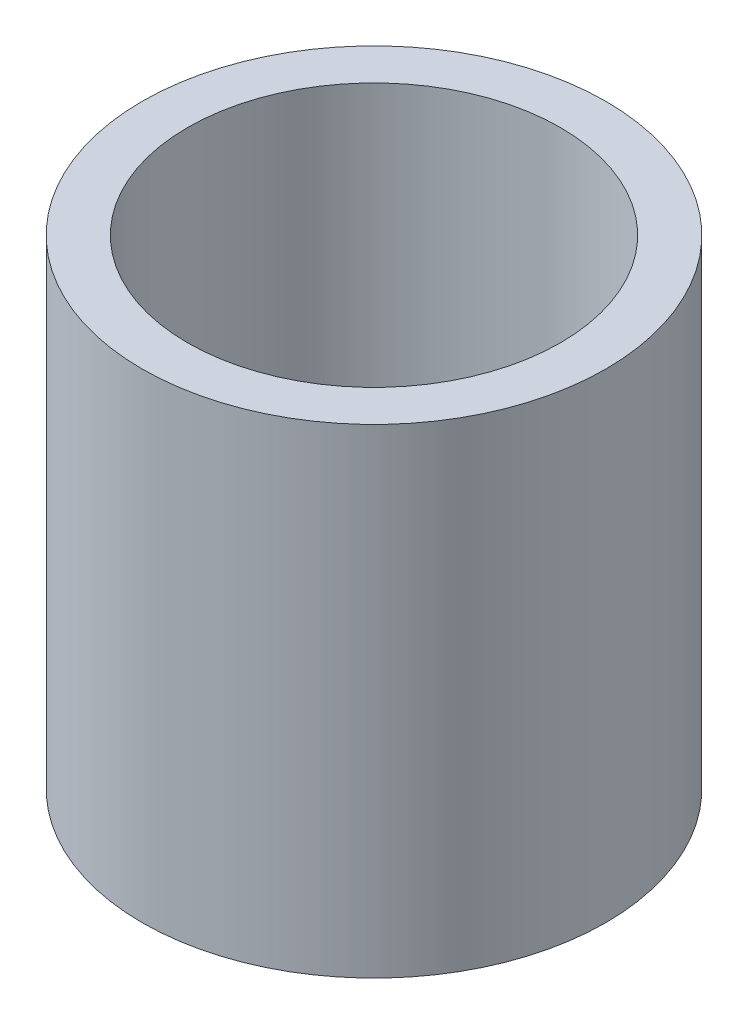
ISO-10303-21;
HEADER;
FILE_DESCRIPTION(('STEP AP214'),'2;1');
FILE_NAME('part.step','',(''),(''),'','','');
FILE_SCHEMA(('AUTOMOTIVE_DESIGN { 1 0 10303 214 1 1 1 1 }'));
ENDSEC;
DATA;
#1=APPLICATION_CONTEXT('core data for automotive mechanical design processes');
#2=APPLICATION_PROTOCOL_DEFINITION('international standard','automotive_design',2000,#1);
#3=PRODUCT_CONTEXT('',#1,'mechanical');
#4=PRODUCT('Part','Part','',(#3));
#5=PRODUCT_RELATED_PRODUCT_CATEGORY('part','',(#4));
#6=PRODUCT_DEFINITION_FORMATION('','',#4);
#7=PRODUCT_DEFINITION_CONTEXT('part definition',#1,'design');
#8=PRODUCT_DEFINITION('design','',#6,#7);
#9=PRODUCT_DEFINITION_SHAPE('','',#8);
#10=(LENGTH_UNIT() NAMED_UNIT(*) SI_UNIT(.MILLI.,.METRE.));
#11=(NAMED_UNIT(*) PLANE_ANGLE_UNIT() SI_UNIT($,.RADIAN.));
#12=(NAMED_UNIT(*) SI_UNIT($,.STERADIAN.) SOLID_ANGLE_UNIT());
#13=UNCERTAINTY_MEASURE_WITH_UNIT(LENGTH_MEASURE(1.E-05),#10,'distance_accuracy_value','');
#14=(GEOMETRIC_REPRESENTATION_CONTEXT(3) GLOBAL_UNCERTAINTY_ASSIGNED_CONTEXT((#13)) GLOBAL_UNIT_ASSIGNED_CONTEXT((#10,
#11,#12)) REPRESENTATION_CONTEXT('',''));
#15=CARTESIAN_POINT('',(0.,0.,0.));
#16=DIRECTION('',(0.,0.,1.));
#17=DIRECTION('',(1.,0.,0.));
#18=AXIS2_PLACEMENT_3D('',#15,#16,#17);
#19=CARTESIAN_POINT('',(0.,56.8773661737675,0.));
#20=DIRECTION('',(0.,-1.,0.));
#21=DIRECTION('',(0.,0.,-1.));
#22=AXIS2_PLACEMENT_3D('',#19,#20,#21);
#23=CYLINDRICAL_SURFACE('',#22,27.5);
#24=CARTESIAN_POINT('',(0.,56.8773661737675,0.));
#25=DIRECTION('',(0.,1.,0.));
#26=DIRECTION('',(0.,0.,1.));
#27=AXIS2_PLACEMENT_3D('',#24,#25,#26);
#28=CIRCLE('',#27,27.5);
#29=CARTESIAN_POINT('',(0.,56.8773661737675,27.5));
#30=VERTEX_POINT('',#29);
#31=EDGE_CURVE('E10',#30,#30,#28,.T.);
#32=ORIENTED_EDGE('',*,*,#31,.F.);
#33=EDGE_LOOP('',(#32));
#34=FACE_BOUND('',#33,.T.);
#35=CARTESIAN_POINT('',(0.,0.,0.));
#36=DIRECTION('',(0.,1.,0.));
#37=DIRECTION('',(0.,0.,1.));
#38=AXIS2_PLACEMENT_3D('',#35,#36,#37);
#39=CIRCLE('',#38,27.5);
#40=CARTESIAN_POINT('',(0.,0.,27.5));
#41=VERTEX_POINT('',#40);
#42=EDGE_CURVE('E37',#41,#41,#39,.T.);
#43=ORIENTED_EDGE('',*,*,#42,.T.);
#44=EDGE_LOOP('',(#43));
#45=FACE_BOUND('',#44,.T.);
#46=ADVANCED_FACE('F40',(#34,#45),#23,.T.);
#47=CARTESIAN_POINT('',(0.,56.8773661737675,0.));
#48=DIRECTION('',(0.,1.,0.));
#49=DIRECTION('',(0.,0.,1.));
#50=AXIS2_PLACEMENT_3D('',#47,#48,#49);
#51=PLANE('',#50);
#52=CARTESIAN_POINT('',(0.,56.8773661737675,0.));
#53=DIRECTION('',(0.,1.,0.));
#54=DIRECTION('',(0.,0.,1.));
#55=AXIS2_PLACEMENT_3D('',#52,#53,#54);
#56=CIRCLE('',#55,22.1179336310488);
#57=CARTESIAN_POINT('',(0.,56.8773661737675,22.1179336310488));
#58=VERTEX_POINT('',#57);
#59=EDGE_CURVE('E50',#58,#58,#56,.T.);
#60=ORIENTED_EDGE('',*,*,#59,.F.);
#61=EDGE_LOOP('',(#60));
#62=FACE_BOUND('',#61,.T.);
#63=ORIENTED_EDGE('',*,*,#31,.T.);
#64=EDGE_LOOP('',(#63));
#65=FACE_BOUND('',#64,.T.);
#66=ADVANCED_FACE('F59',(#62,#65),#51,.T.);
#67=CARTESIAN_POINT('',(0.,0.,0.));
#68=DIRECTION('',(0.,1.,0.));
#69=DIRECTION('',(0.,0.,1.));
#70=AXIS2_PLACEMENT_3D('',#67,#68,#69);
#71=PLANE('',#70);
#72=CARTESIAN_POINT('',(0.,0.,0.));
#73=DIRECTION('',(0.,1.,0.));
#74=DIRECTION('',(0.,0.,1.));
#75=AXIS2_PLACEMENT_3D('',#72,#73,#74);
#76=CIRCLE('',#75,22.1179336310488);
#77=CARTESIAN_POINT('',(0.,0.,22.1179336310488));
#78=VERTEX_POINT('',#77);
#79=EDGE_CURVE('E47',#78,#78,#76,.T.);
#80=ORIENTED_EDGE('',*,*,#79,.T.);
#81=EDGE_LOOP('',(#80));
#82=FACE_BOUND('',#81,.T.);
#83=ORIENTED_EDGE('',*,*,#42,.F.);
#84=EDGE_LOOP('',(#83));
#85=FACE_BOUND('',#84,.T.);
#86=ADVANCED_FACE('F58',(#82,#85),#71,.F.);
#87=CARTESIAN_POINT('',(0.,56.8773661737675,0.));
#88=DIRECTION('',(0.,-1.,0.));
#89=DIRECTION('',(0.,0.,-1.));
#90=AXIS2_PLACEMENT_3D('',#87,#88,#89);
#91=CYLINDRICAL_SURFACE('',#90,22.1179336310488);
#92=ORIENTED_EDGE('',*,*,#59,.T.);
#93=EDGE_LOOP('',(#92));
#94=FACE_BOUND('',#93,.T.);
#95=ORIENTED_EDGE('',*,*,#79,.F.);
#96=EDGE_LOOP('',(#95));
#97=FACE_BOUND('',#96,.T.);
#98=ADVANCED_FACE('F54',(#94,#97),#91,.F.);
#99=CLOSED_SHELL('',(#46,#66,#86,#98));
#100=MANIFOLD_SOLID_BREP('B2',#99);
#101=ADVANCED_BREP_SHAPE_REPRESENTATION('',(#18,#100),#14);
#102=SHAPE_DEFINITION_REPRESENTATION(#9,#101);
ENDSEC;
END-ISO-10303-21;
